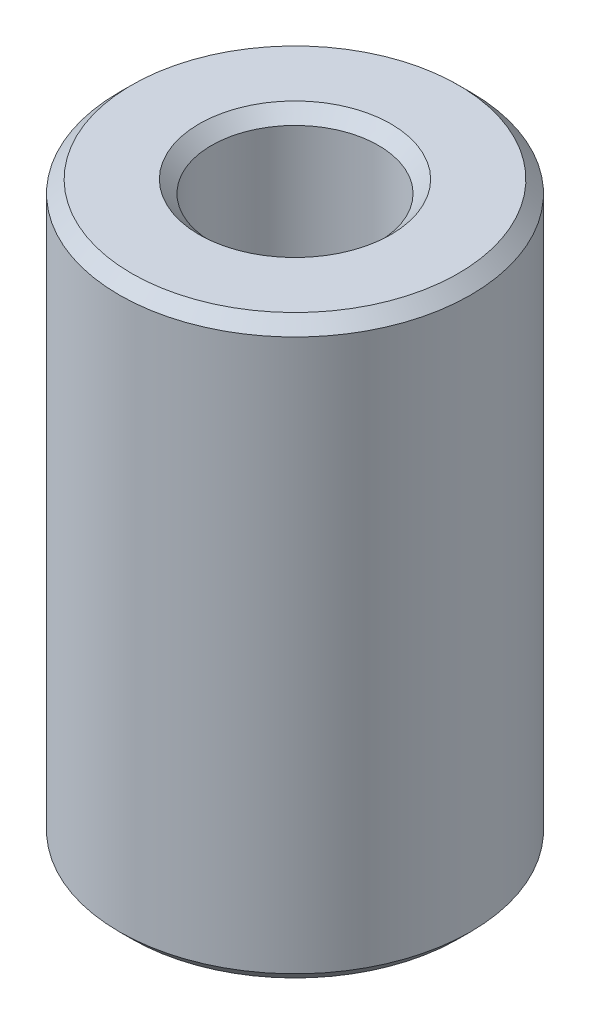
ISO-10303-21;
HEADER;
FILE_DESCRIPTION(('STEP AP214'),'2;1');
FILE_NAME('part.step','',(''),(''),'','','');
FILE_SCHEMA(('AUTOMOTIVE_DESIGN { 1 0 10303 214 1 1 1 1 }'));
ENDSEC;
DATA;
#1=APPLICATION_CONTEXT('core data for automotive mechanical design processes');
#2=APPLICATION_PROTOCOL_DEFINITION('international standard','automotive_design',2000,#1);
#3=PRODUCT_CONTEXT('',#1,'mechanical');
#4=PRODUCT('Part','Part','',(#3));
#5=PRODUCT_RELATED_PRODUCT_CATEGORY('part','',(#4));
#6=PRODUCT_DEFINITION_FORMATION('','',#4);
#7=PRODUCT_DEFINITION_CONTEXT('part definition',#1,'design');
#8=PRODUCT_DEFINITION('design','',#6,#7);
#9=PRODUCT_DEFINITION_SHAPE('','',#8);
#10=(LENGTH_UNIT() NAMED_UNIT(*) SI_UNIT(.MILLI.,.METRE.));
#11=(NAMED_UNIT(*) PLANE_ANGLE_UNIT() SI_UNIT($,.RADIAN.));
#12=(NAMED_UNIT(*) SI_UNIT($,.STERADIAN.) SOLID_ANGLE_UNIT());
#13=UNCERTAINTY_MEASURE_WITH_UNIT(LENGTH_MEASURE(1.E-05),#10,'distance_accuracy_value','');
#14=(GEOMETRIC_REPRESENTATION_CONTEXT(3) GLOBAL_UNCERTAINTY_ASSIGNED_CONTEXT((#13)) GLOBAL_UNIT_ASSIGNED_CONTEXT((#10,
#11,#12)) REPRESENTATION_CONTEXT('',''));
#15=CARTESIAN_POINT('',(0.,0.,0.));
#16=DIRECTION('',(0.,0.,1.));
#17=DIRECTION('',(1.,0.,0.));
#18=AXIS2_PLACEMENT_3D('',#15,#16,#17);
#19=CARTESIAN_POINT('',(0.,180.409729087368,0.));
#20=DIRECTION('',(0.,-1.,0.));
#21=DIRECTION('',(0.,0.,-1.));
#22=AXIS2_PLACEMENT_3D('',#19,#20,#21);
#23=CYLINDRICAL_SURFACE('',#22,55.);
#24=CARTESIAN_POINT('',(0.,3.88859011924655,0.));
#25=DIRECTION('',(0.,1.,0.));
#26=DIRECTION('',(0.,0.,1.));
#27=AXIS2_PLACEMENT_3D('',#24,#25,#26);
#28=CIRCLE('',#27,55.);
#29=CARTESIAN_POINT('',(0.,3.88859011924655,55.));
#30=VERTEX_POINT('',#29);
#31=EDGE_CURVE('E10',#30,#30,#28,.T.);
#32=ORIENTED_EDGE('',*,*,#31,.T.);
#33=EDGE_LOOP('',(#32));
#34=FACE_BOUND('',#33,.T.);
#35=CARTESIAN_POINT('',(0.,176.521138968122,0.));
#36=DIRECTION('',(0.,1.,0.));
#37=DIRECTION('',(0.,0.,1.));
#38=AXIS2_PLACEMENT_3D('',#35,#36,#37);
#39=CIRCLE('',#38,55.);
#40=CARTESIAN_POINT('',(0.,176.521138968122,55.));
#41=VERTEX_POINT('',#40);
#42=EDGE_CURVE('E50',#41,#41,#39,.F.);
#43=ORIENTED_EDGE('',*,*,#42,.T.);
#44=EDGE_LOOP('',(#43));
#45=FACE_BOUND('',#44,.T.);
#46=ADVANCED_FACE('F39',(#34,#45),#23,.T.);
#47=CARTESIAN_POINT('',(0.,180.409729087368,0.));
#48=DIRECTION('',(0.,1.,0.));
#49=DIRECTION('',(0.,0.,1.));
#50=AXIS2_PLACEMENT_3D('',#47,#48,#49);
#51=PLANE('',#50);
#52=CARTESIAN_POINT('',(0.,180.409729087368,0.));
#53=DIRECTION('',(0.,1.,0.));
#54=DIRECTION('',(0.,0.,1.));
#55=AXIS2_PLACEMENT_3D('',#52,#53,#54);
#56=CIRCLE('',#55,30.0312135399466);
#57=CARTESIAN_POINT('',(0.,180.409729087368,30.0312135399466));
#58=VERTEX_POINT('',#57);
#59=EDGE_CURVE('E58',#58,#58,#56,.F.);
#60=ORIENTED_EDGE('',*,*,#59,.T.);
#61=EDGE_LOOP('',(#60));
#62=FACE_BOUND('',#61,.T.);
#63=CARTESIAN_POINT('',(0.,180.409729087368,0.));
#64=DIRECTION('',(0.,1.,0.));
#65=DIRECTION('',(0.,0.,1.));
#66=AXIS2_PLACEMENT_3D('',#63,#64,#65);
#67=CIRCLE('',#66,51.1114098807535);
#68=CARTESIAN_POINT('',(0.,180.409729087368,51.1114098807535));
#69=VERTEX_POINT('',#68);
#70=EDGE_CURVE('E61',#69,#69,#67,.T.);
#71=ORIENTED_EDGE('',*,*,#70,.T.);
#72=EDGE_LOOP('',(#71));
#73=FACE_BOUND('',#72,.T.);
#74=ADVANCED_FACE('F88',(#62,#73),#51,.T.);
#75=CARTESIAN_POINT('',(0.,0.,0.));
#76=DIRECTION('',(0.,1.,0.));
#77=DIRECTION('',(0.,0.,1.));
#78=AXIS2_PLACEMENT_3D('',#75,#76,#77);
#79=PLANE('',#78);
#80=CARTESIAN_POINT('',(0.,0.,0.));
#81=DIRECTION('',(0.,1.,0.));
#82=DIRECTION('',(0.,0.,1.));
#83=AXIS2_PLACEMENT_3D('',#80,#81,#82);
#84=CIRCLE('',#83,30.0312135399466);
#85=CARTESIAN_POINT('',(0.,0.,30.0312135399466));
#86=VERTEX_POINT('',#85);
#87=EDGE_CURVE('E51',#86,#86,#84,.T.);
#88=ORIENTED_EDGE('',*,*,#87,.T.);
#89=EDGE_LOOP('',(#88));
#90=FACE_BOUND('',#89,.T.);
#91=CARTESIAN_POINT('',(0.,0.,0.));
#92=DIRECTION('',(0.,1.,0.));
#93=DIRECTION('',(0.,0.,1.));
#94=AXIS2_PLACEMENT_3D('',#91,#92,#93);
#95=CIRCLE('',#94,51.1114098807534);
#96=CARTESIAN_POINT('',(0.,0.,51.1114098807534));
#97=VERTEX_POINT('',#96);
#98=EDGE_CURVE('E54',#97,#97,#95,.F.);
#99=ORIENTED_EDGE('',*,*,#98,.T.);
#100=EDGE_LOOP('',(#99));
#101=FACE_BOUND('',#100,.T.);
#102=ADVANCED_FACE('F83',(#90,#101),#79,.F.);
#103=CARTESIAN_POINT('',(0.,180.409729087368,0.));
#104=DIRECTION('',(0.,-1.,0.));
#105=DIRECTION('',(0.,0.,-1.));
#106=AXIS2_PLACEMENT_3D('',#103,#104,#105);
#107=CYLINDRICAL_SURFACE('',#106,26.1426234207001);
#108=CARTESIAN_POINT('',(0.,176.521138968122,0.));
#109=DIRECTION('',(0.,1.,0.));
#110=DIRECTION('',(0.,0.,1.));
#111=AXIS2_PLACEMENT_3D('',#108,#109,#110);
#112=CIRCLE('',#111,26.1426234207001);
#113=CARTESIAN_POINT('',(0.,176.521138968122,26.1426234207001));
#114=VERTEX_POINT('',#113);
#115=EDGE_CURVE('E67',#114,#114,#112,.T.);
#116=ORIENTED_EDGE('',*,*,#115,.T.);
#117=EDGE_LOOP('',(#116));
#118=FACE_BOUND('',#117,.T.);
#119=CARTESIAN_POINT('',(0.,3.88859011924653,0.));
#120=DIRECTION('',(0.,1.,0.));
#121=DIRECTION('',(0.,0.,1.));
#122=AXIS2_PLACEMENT_3D('',#119,#120,#121);
#123=CIRCLE('',#122,26.1426234207001);
#124=CARTESIAN_POINT('',(0.,3.88859011924653,26.1426234207001));
#125=VERTEX_POINT('',#124);
#126=EDGE_CURVE('E69',#125,#125,#123,.F.);
#127=ORIENTED_EDGE('',*,*,#126,.T.);
#128=EDGE_LOOP('',(#127));
#129=FACE_BOUND('',#128,.T.);
#130=ADVANCED_FACE('F71',(#118,#129),#107,.F.);
#131=CARTESIAN_POINT('',(0.,176.521138968122,0.));
#132=DIRECTION('',(0.,1.,0.));
#133=DIRECTION('',(0.,0.,1.));
#134=AXIS2_PLACEMENT_3D('',#131,#132,#133);
#135=CONICAL_SURFACE('',#134,26.1426234207001,0.785398163397449);
#136=ORIENTED_EDGE('',*,*,#59,.F.);
#137=EDGE_LOOP('',(#136));
#138=FACE_BOUND('',#137,.T.);
#139=ORIENTED_EDGE('',*,*,#115,.F.);
#140=EDGE_LOOP('',(#139));
#141=FACE_BOUND('',#140,.T.);
#142=ADVANCED_FACE('F77',(#138,#141),#135,.F.);
#143=CARTESIAN_POINT('',(0.,0.,0.));
#144=DIRECTION('',(0.,-1.,0.));
#145=DIRECTION('',(0.,0.,-1.));
#146=AXIS2_PLACEMENT_3D('',#143,#144,#145);
#147=CONICAL_SURFACE('',#146,30.0312135399466,0.785398163397445);
#148=ORIENTED_EDGE('',*,*,#126,.F.);
#149=EDGE_LOOP('',(#148));
#150=FACE_BOUND('',#149,.T.);
#151=ORIENTED_EDGE('',*,*,#87,.F.);
#152=EDGE_LOOP('',(#151));
#153=FACE_BOUND('',#152,.T.);
#154=ADVANCED_FACE('F73',(#150,#153),#147,.F.);
#155=CARTESIAN_POINT('',(0.,3.88859011924655,0.));
#156=DIRECTION('',(0.,1.,0.));
#157=DIRECTION('',(0.,0.,1.));
#158=AXIS2_PLACEMENT_3D('',#155,#156,#157);
#159=CONICAL_SURFACE('',#158,55.,0.785398163397453);
#160=CARTESIAN_POINT('',(0.,0.,51.1114098807534));
#161=CARTESIAN_POINT('',(0.,0.0405061470754863,51.1519160278289));
#162=CARTESIAN_POINT('',(0.,0.0810122941509706,51.1924221749044));
#163=CARTESIAN_POINT('',(0.,0.162024588301939,51.2734344690554));
#164=CARTESIAN_POINT('',(0.,0.202530735377424,51.3139406161308));
#165=CARTESIAN_POINT('',(0.,0.283543029528394,51.3949529102818));
#166=CARTESIAN_POINT('',(0.,0.324049176603879,51.4354590573573));
#167=CARTESIAN_POINT('',(0.,0.40506147075485,51.5164713515083));
#168=CARTESIAN_POINT('',(0.,0.445567617830334,51.5569774985837));
#169=CARTESIAN_POINT('',(0.,0.526579911981303,51.6379897927347));
#170=CARTESIAN_POINT('',(0.,0.567086059056788,51.6784959398102));
#171=CARTESIAN_POINT('',(0.,0.648098353207758,51.7595082339612));
#172=CARTESIAN_POINT('',(0.,0.688604500283244,51.8000143810367));
#173=CARTESIAN_POINT('',(0.,0.769616794434214,51.8810266751876));
#174=CARTESIAN_POINT('',(0.,0.810122941509698,51.9215328222631));
#175=CARTESIAN_POINT('',(0.,0.891135235660668,52.0025451164141));
#176=CARTESIAN_POINT('',(0.,0.931641382736154,52.0430512634896));
#177=CARTESIAN_POINT('',(0.,1.01265367688712,52.1240635576405));
#178=CARTESIAN_POINT('',(0.,1.05315982396261,52.164569704716));
#179=CARTESIAN_POINT('',(0.,1.13417211811358,52.245581998867));
#180=CARTESIAN_POINT('',(0.,1.17467826518906,52.2860881459425));
#181=CARTESIAN_POINT('',(0.,1.25569055934003,52.3671004400935));
#182=CARTESIAN_POINT('',(0.,1.29619670641552,52.4076065871689));
#183=CARTESIAN_POINT('',(0.,1.37720900056649,52.4886188813199));
#184=CARTESIAN_POINT('',(0.,1.41771514764197,52.5291250283954));
#185=CARTESIAN_POINT('',(0.,1.49872744179294,52.6101373225464));
#186=CARTESIAN_POINT('',(0.,1.53923358886843,52.6506434696219));
#187=CARTESIAN_POINT('',(0.,1.6202458830194,52.7316557637728));
#188=CARTESIAN_POINT('',(0.,1.66075203009488,52.7721619108483));
#189=CARTESIAN_POINT('',(0.,1.74176432424585,52.8531742049993));
#190=CARTESIAN_POINT('',(0.,1.78227047132134,52.8936803520748));
#191=CARTESIAN_POINT('',(0.,1.86328276547231,52.9746926462257));
#192=CARTESIAN_POINT('',(0.,1.90378891254779,53.0151987933012));
#193=CARTESIAN_POINT('',(0.,1.98480120669876,53.0962110874522));
#194=CARTESIAN_POINT('',(0.,2.02530735377425,53.1367172345277));
#195=CARTESIAN_POINT('',(0.,2.10631964792522,53.2177295286786));
#196=CARTESIAN_POINT('',(0.,2.1468257950007,53.2582356757541));
#197=CARTESIAN_POINT('',(0.,2.22783808915167,53.3392479699051));
#198=CARTESIAN_POINT('',(0.,2.26834423622716,53.3797541169806));
#199=CARTESIAN_POINT('',(0.,2.34935653037813,53.4607664111316));
#200=CARTESIAN_POINT('',(0.,2.38986267745361,53.501272558207));
#201=CARTESIAN_POINT('',(0.,2.47087497160458,53.582284852358));
#202=CARTESIAN_POINT('',(0.,2.51138111868007,53.6227909994335));
#203=CARTESIAN_POINT('',(0.,2.59239341283104,53.7038032935845));
#204=CARTESIAN_POINT('',(0.,2.63289955990652,53.74430944066));
#205=CARTESIAN_POINT('',(0.,2.71391185405749,53.8253217348109));
#206=CARTESIAN_POINT('',(0.,2.75441800113298,53.8658278818864));
#207=CARTESIAN_POINT('',(0.,2.83543029528395,53.9468401760374));
#208=CARTESIAN_POINT('',(0.,2.87593644235943,53.9873463231129));
#209=CARTESIAN_POINT('',(0.,2.9569487365104,54.0683586172638));
#210=CARTESIAN_POINT('',(0.,2.99745488358589,54.1088647643393));
#211=CARTESIAN_POINT('',(0.,3.07846717773686,54.1898770584903));
#212=CARTESIAN_POINT('',(0.,3.11897332481234,54.2303832055658));
#213=CARTESIAN_POINT('',(0.,3.19998561896331,54.3113954997168));
#214=CARTESIAN_POINT('',(0.,3.2404917660388,54.3519016467922));
#215=CARTESIAN_POINT('',(0.,3.32150406018977,54.4329139409432));
#216=CARTESIAN_POINT('',(0.,3.36201020726525,54.4734200880187));
#217=CARTESIAN_POINT('',(0.,3.44302250141622,54.5544323821697));
#218=CARTESIAN_POINT('',(0.,3.48352864849171,54.5949385292451));
#219=CARTESIAN_POINT('',(0.,3.56454094264268,54.6759508233961));
#220=CARTESIAN_POINT('',(0.,3.60504708971816,54.7164569704716));
#221=CARTESIAN_POINT('',(0.,3.68605938386913,54.7974692646226));
#222=CARTESIAN_POINT('',(0.,3.72656553094461,54.8379754116981));
#223=CARTESIAN_POINT('',(0.,3.80757782509559,54.918987705849));
#224=CARTESIAN_POINT('',(0.,3.84808397217107,54.9594938529245));
#225=CARTESIAN_POINT('',(0.,3.88859011924655,55.));
#226=B_SPLINE_CURVE_WITH_KNOTS('',3,(#160,#161,#162,#163,#164,#165,#166,#167,#168,#169,#170,
#171,#172,#173,#174,#175,#176,#177,#178,#179,#180,#181,#182,#183,#184,#185,#186,#187,#188,#189,
#190,#191,#192,#193,#194,#195,#196,#197,#198,#199,#200,#201,#202,#203,#204,#205,#206,#207,#208,
#209,#210,#211,#212,#213,#214,#215,#216,#217,#218,#219,#220,#221,#222,#223,#224,#225),
.UNSPECIFIED.,.F.,.F.,(4,2,2,2,2,2,2,2,2,2,2,2,2,2,2,2,2,2,2,2,2,2,2,2,2,2,2,2,2,2,2,2,4),(0.,
0.171853027660888,0.343706055321782,0.51555908298267,0.687412110643563,0.859265138304457,
1.03111816596535,1.20297119362624,1.37482422128713,1.54667724894802,1.71853027660891,
1.8903833042698,2.06223633193069,2.23408935959158,2.40594238725247,2.57779541491337,
2.74964844257425,2.92150147023515,3.09335449789604,3.26520752555693,3.43706055321782,
3.60891358087871,3.7807666085396,3.95261963620049,4.12447266386138,4.29632569152227,
4.46817871918317,4.64003174684406,4.81188477450495,4.98373780216584,5.15559082982673,
5.32744385748762,5.49929688514851),.UNSPECIFIED.);
#227=EDGE_CURVE('BSEAM76',#97,#30,#226,.T.);
#228=ORIENTED_EDGE('',*,*,#98,.F.);
#229=ORIENTED_EDGE('',*,*,#31,.F.);
#230=ORIENTED_EDGE('',*,*,#227,.T.);
#231=ORIENTED_EDGE('',*,*,#227,.F.);
#232=EDGE_LOOP('',(#228,#230,#229,#231));
#233=FACE_BOUND('',#232,.T.);
#234=ADVANCED_FACE('F76',(#233),#159,.T.);
#235=CARTESIAN_POINT('',(0.,180.409729087368,0.));
#236=DIRECTION('',(0.,-1.,0.));
#237=DIRECTION('',(0.,0.,-1.));
#238=AXIS2_PLACEMENT_3D('',#235,#236,#237);
#239=CONICAL_SURFACE('',#238,51.1114098807535,0.785398163397442);
#240=ORIENTED_EDGE('',*,*,#42,.F.);
#241=EDGE_LOOP('',(#240));
#242=FACE_BOUND('',#241,.T.);
#243=ORIENTED_EDGE('',*,*,#70,.F.);
#244=EDGE_LOOP('',(#243));
#245=FACE_BOUND('',#244,.T.);
#246=ADVANCED_FACE('F45',(#242,#245),#239,.T.);
#247=CLOSED_SHELL('',(#46,#74,#102,#130,#142,#154,#234,#246));
#248=MANIFOLD_SOLID_BREP('B2',#247);
#249=ADVANCED_BREP_SHAPE_REPRESENTATION('',(#18,#248),#14);
#250=SHAPE_DEFINITION_REPRESENTATION(#9,#249);
ENDSEC;
END-ISO-10303-21;
